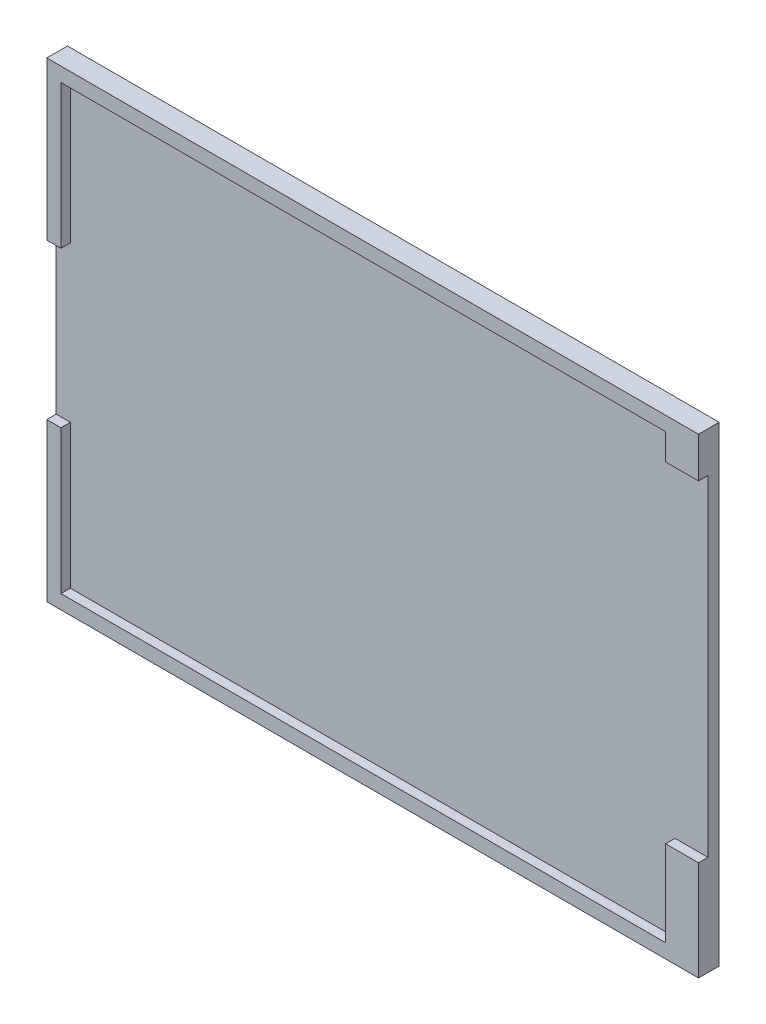
ISO-10303-21;
HEADER;
FILE_DESCRIPTION(('STEP AP214'),'2;1');
FILE_NAME('part.step','',(''),(''),'','','');
FILE_SCHEMA(('AUTOMOTIVE_DESIGN { 1 0 10303 214 1 1 1 1 }'));
ENDSEC;
DATA;
#1=APPLICATION_CONTEXT('core data for automotive mechanical design processes');
#2=APPLICATION_PROTOCOL_DEFINITION('international standard','automotive_design',2000,#1);
#3=PRODUCT_CONTEXT('',#1,'mechanical');
#4=PRODUCT('Part','Part','',(#3));
#5=PRODUCT_RELATED_PRODUCT_CATEGORY('part','',(#4));
#6=PRODUCT_DEFINITION_FORMATION('','',#4);
#7=PRODUCT_DEFINITION_CONTEXT('part definition',#1,'design');
#8=PRODUCT_DEFINITION('design','',#6,#7);
#9=PRODUCT_DEFINITION_SHAPE('','',#8);
#10=(LENGTH_UNIT() NAMED_UNIT(*) SI_UNIT(.MILLI.,.METRE.));
#11=(NAMED_UNIT(*) PLANE_ANGLE_UNIT() SI_UNIT($,.RADIAN.));
#12=(NAMED_UNIT(*) SI_UNIT($,.STERADIAN.) SOLID_ANGLE_UNIT());
#13=UNCERTAINTY_MEASURE_WITH_UNIT(LENGTH_MEASURE(1.E-05),#10,'distance_accuracy_value','');
#14=(GEOMETRIC_REPRESENTATION_CONTEXT(3) GLOBAL_UNCERTAINTY_ASSIGNED_CONTEXT((#13)) GLOBAL_UNIT_ASSIGNED_CONTEXT((#10,
#11,#12)) REPRESENTATION_CONTEXT('',''));
#15=CARTESIAN_POINT('',(0.,0.,0.));
#16=DIRECTION('',(0.,0.,1.));
#17=DIRECTION('',(1.,0.,0.));
#18=AXIS2_PLACEMENT_3D('',#15,#16,#17);
#19=CARTESIAN_POINT('',(0.,0.,2.2));
#20=DIRECTION('',(0.,0.,-1.));
#21=DIRECTION('',(-1.,0.,0.));
#22=AXIS2_PLACEMENT_3D('',#19,#20,#21);
#23=PLANE('',#22);
#24=DIRECTION('',(0.,-1.,0.));
#25=VECTOR('',#24,1.);
#26=CARTESIAN_POINT('',(-34.6,-25.,2.2));
#27=LINE('',#26,#25);
#28=CARTESIAN_POINT('',(-34.6,25.,2.2));
#29=VERTEX_POINT('',#28);
#30=CARTESIAN_POINT('',(-34.6,8.25,2.2));
#31=VERTEX_POINT('',#30);
#32=EDGE_CURVE('E190',#29,#31,#27,.T.);
#33=ORIENTED_EDGE('',*,*,#32,.T.);
#34=DIRECTION('',(-1.,0.,0.));
#35=VECTOR('',#34,1.);
#36=CARTESIAN_POINT('',(-34.5108366178629,8.25,2.2));
#37=LINE('',#36,#35);
#38=CARTESIAN_POINT('',(-33.0953892850898,8.24999999999999,2.2));
#39=VERTEX_POINT('',#38);
#40=EDGE_CURVE('E173',#39,#31,#37,.T.);
#41=ORIENTED_EDGE('',*,*,#40,.F.);
#42=DIRECTION('',(0.,-1.,0.));
#43=VECTOR('',#42,1.);
#44=CARTESIAN_POINT('',(-33.0953892850898,23.4955863264488,2.2));
#45=LINE('',#44,#43);
#46=CARTESIAN_POINT('',(-33.0953892850898,23.4955863264488,2.2));
#47=VERTEX_POINT('',#46);
#48=EDGE_CURVE('E311',#47,#39,#45,.T.);
#49=ORIENTED_EDGE('',*,*,#48,.F.);
#50=DIRECTION('',(-1.,0.,0.));
#51=VECTOR('',#50,1.);
#52=CARTESIAN_POINT('',(31.1043201226952,23.4955863264488,2.2));
#53=LINE('',#52,#51);
#54=CARTESIAN_POINT('',(31.1043201226952,23.4955863264488,2.2));
#55=VERTEX_POINT('',#54);
#56=EDGE_CURVE('E308',#55,#47,#53,.T.);
#57=ORIENTED_EDGE('',*,*,#56,.F.);
#58=DIRECTION('',(0.,1.,0.));
#59=VECTOR('',#58,1.);
#60=CARTESIAN_POINT('',(31.1043201226952,20.7043143379455,2.2));
#61=LINE('',#60,#59);
#62=CARTESIAN_POINT('',(31.1043201226952,20.7043143379455,2.2));
#63=VERTEX_POINT('',#62);
#64=EDGE_CURVE('E305',#63,#55,#61,.T.);
#65=ORIENTED_EDGE('',*,*,#64,.F.);
#66=DIRECTION('',(-1.,0.,0.));
#67=VECTOR('',#66,1.);
#68=CARTESIAN_POINT('',(34.6,20.7043143379455,2.2));
#69=LINE('',#68,#67);
#70=CARTESIAN_POINT('',(34.6,20.7043143379455,2.2));
#71=VERTEX_POINT('',#70);
#72=EDGE_CURVE('E302',#71,#63,#69,.T.);
#73=ORIENTED_EDGE('',*,*,#72,.F.);
#74=DIRECTION('',(0.,1.,0.));
#75=VECTOR('',#74,1.);
#76=CARTESIAN_POINT('',(34.6,-25.,2.2));
#77=LINE('',#76,#75);
#78=CARTESIAN_POINT('',(34.6,25.,2.2));
#79=VERTEX_POINT('',#78);
#80=EDGE_CURVE('E85',#71,#79,#77,.T.);
#81=ORIENTED_EDGE('',*,*,#80,.T.);
#82=DIRECTION('',(-1.,0.,0.));
#83=VECTOR('',#82,1.);
#84=CARTESIAN_POINT('',(-34.6,25.,2.2));
#85=LINE('',#84,#83);
#86=EDGE_CURVE('E188',#79,#29,#85,.T.);
#87=ORIENTED_EDGE('',*,*,#86,.T.);
#88=EDGE_LOOP('',(#33,#41,#49,#57,#65,#73,#81,#87));
#89=FACE_BOUND('',#88,.T.);
#90=ADVANCED_FACE('F32',(#89),#23,.F.);
#91=CARTESIAN_POINT('',(34.6,-25.,2.2));
#92=DIRECTION('',(-1.,0.,0.));
#93=DIRECTION('',(0.,0.,1.));
#94=AXIS2_PLACEMENT_3D('',#91,#92,#93);
#95=PLANE('',#94);
#96=ORIENTED_EDGE('',*,*,#80,.F.);
#97=DIRECTION('',(0.,0.,1.));
#98=VECTOR('',#97,1.);
#99=CARTESIAN_POINT('',(34.6,20.7043143379455,1.2));
#100=LINE('',#99,#98);
#101=CARTESIAN_POINT('',(34.6,20.7043143379455,1.2));
#102=VERTEX_POINT('',#101);
#103=EDGE_CURVE('E324',#102,#71,#100,.T.);
#104=ORIENTED_EDGE('',*,*,#103,.F.);
#105=DIRECTION('',(0.,1.,0.));
#106=VECTOR('',#105,1.);
#107=CARTESIAN_POINT('',(34.6,-14.4042589759396,1.2));
#108=LINE('',#107,#106);
#109=CARTESIAN_POINT('',(34.6,-14.4042589759396,1.2));
#110=VERTEX_POINT('',#109);
#111=EDGE_CURVE('E343',#110,#102,#108,.T.);
#112=ORIENTED_EDGE('',*,*,#111,.F.);
#113=DIRECTION('',(0.,0.,1.));
#114=VECTOR('',#113,1.);
#115=CARTESIAN_POINT('',(34.6,-14.4042589759396,1.2));
#116=LINE('',#115,#114);
#117=CARTESIAN_POINT('',(34.6,-14.4042589759396,2.2));
#118=VERTEX_POINT('',#117);
#119=EDGE_CURVE('E326',#110,#118,#116,.T.);
#120=ORIENTED_EDGE('',*,*,#119,.T.);
#121=CARTESIAN_POINT('',(34.6,-25.,2.2));
#122=VERTEX_POINT('',#121);
#123=EDGE_CURVE('E186',#122,#118,#77,.T.);
#124=ORIENTED_EDGE('',*,*,#123,.F.);
#125=DIRECTION('',(0.,0.,-1.));
#126=VECTOR('',#125,1.);
#127=CARTESIAN_POINT('',(34.6,-25.,2.2));
#128=LINE('',#127,#126);
#129=CARTESIAN_POINT('',(34.6,-25.,0.));
#130=VERTEX_POINT('',#129);
#131=EDGE_CURVE('E194',#122,#130,#128,.T.);
#132=ORIENTED_EDGE('',*,*,#131,.T.);
#133=DIRECTION('',(0.,1.,0.));
#134=VECTOR('',#133,1.);
#135=CARTESIAN_POINT('',(34.6,-25.,0.));
#136=LINE('',#135,#134);
#137=CARTESIAN_POINT('',(34.6,25.,0.));
#138=VERTEX_POINT('',#137);
#139=EDGE_CURVE('E195',#130,#138,#136,.T.);
#140=ORIENTED_EDGE('',*,*,#139,.T.);
#141=DIRECTION('',(0.,0.,-1.));
#142=VECTOR('',#141,1.);
#143=CARTESIAN_POINT('',(34.6,25.,2.2));
#144=LINE('',#143,#142);
#145=EDGE_CURVE('E11',#79,#138,#144,.T.);
#146=ORIENTED_EDGE('',*,*,#145,.F.);
#147=EDGE_LOOP('',(#96,#104,#112,#120,#124,#132,#140,#146));
#148=FACE_BOUND('',#147,.T.);
#149=ADVANCED_FACE('F34',(#148),#95,.F.);
#150=CARTESIAN_POINT('',(-34.6,25.,2.2));
#151=DIRECTION('',(0.,-1.,0.));
#152=DIRECTION('',(0.,0.,-1.));
#153=AXIS2_PLACEMENT_3D('',#150,#151,#152);
#154=PLANE('',#153);
#155=DIRECTION('',(-1.,0.,0.));
#156=VECTOR('',#155,1.);
#157=CARTESIAN_POINT('',(-34.6,25.,0.));
#158=LINE('',#157,#156);
#159=CARTESIAN_POINT('',(-34.6,25.,0.));
#160=VERTEX_POINT('',#159);
#161=EDGE_CURVE('E198',#138,#160,#158,.T.);
#162=ORIENTED_EDGE('',*,*,#161,.T.);
#163=DIRECTION('',(0.,0.,-1.));
#164=VECTOR('',#163,1.);
#165=CARTESIAN_POINT('',(-34.6,25.,2.2));
#166=LINE('',#165,#164);
#167=EDGE_CURVE('E40',#29,#160,#166,.T.);
#168=ORIENTED_EDGE('',*,*,#167,.F.);
#169=ORIENTED_EDGE('',*,*,#86,.F.);
#170=ORIENTED_EDGE('',*,*,#145,.T.);
#171=EDGE_LOOP('',(#162,#168,#169,#170));
#172=FACE_BOUND('',#171,.T.);
#173=ADVANCED_FACE('F229',(#172),#154,.F.);
#174=CARTESIAN_POINT('',(-34.6,-25.,2.2));
#175=DIRECTION('',(1.,0.,0.));
#176=DIRECTION('',(0.,0.,-1.));
#177=AXIS2_PLACEMENT_3D('',#174,#175,#176);
#178=PLANE('',#177);
#179=DIRECTION('',(0.,-1.,0.));
#180=VECTOR('',#179,1.);
#181=CARTESIAN_POINT('',(-34.6,8.25,1.2));
#182=LINE('',#181,#180);
#183=CARTESIAN_POINT('',(-34.6,8.25,1.2));
#184=VERTEX_POINT('',#183);
#185=CARTESIAN_POINT('',(-34.6,-8.25,1.2));
#186=VERTEX_POINT('',#185);
#187=EDGE_CURVE('E163',#184,#186,#182,.T.);
#188=ORIENTED_EDGE('',*,*,#187,.F.);
#189=DIRECTION('',(0.,0.,1.));
#190=VECTOR('',#189,1.);
#191=CARTESIAN_POINT('',(-34.6,8.25,1.2));
#192=LINE('',#191,#190);
#193=EDGE_CURVE('E199',#184,#31,#192,.T.);
#194=ORIENTED_EDGE('',*,*,#193,.T.);
#195=ORIENTED_EDGE('',*,*,#32,.F.);
#196=ORIENTED_EDGE('',*,*,#167,.T.);
#197=DIRECTION('',(0.,-1.,0.));
#198=VECTOR('',#197,1.);
#199=CARTESIAN_POINT('',(-34.6,-25.,0.));
#200=LINE('',#199,#198);
#201=CARTESIAN_POINT('',(-34.6,-25.,0.));
#202=VERTEX_POINT('',#201);
#203=EDGE_CURVE('E201',#160,#202,#200,.T.);
#204=ORIENTED_EDGE('',*,*,#203,.T.);
#205=DIRECTION('',(0.,0.,-1.));
#206=VECTOR('',#205,1.);
#207=CARTESIAN_POINT('',(-34.6,-25.,2.2));
#208=LINE('',#207,#206);
#209=CARTESIAN_POINT('',(-34.6,-25.,2.2));
#210=VERTEX_POINT('',#209);
#211=EDGE_CURVE('E205',#210,#202,#208,.T.);
#212=ORIENTED_EDGE('',*,*,#211,.F.);
#213=CARTESIAN_POINT('',(-34.6,-8.25,2.2));
#214=VERTEX_POINT('',#213);
#215=EDGE_CURVE('E178',#214,#210,#27,.T.);
#216=ORIENTED_EDGE('',*,*,#215,.F.);
#217=DIRECTION('',(0.,0.,1.));
#218=VECTOR('',#217,1.);
#219=CARTESIAN_POINT('',(-34.6,-8.25,1.2));
#220=LINE('',#219,#218);
#221=EDGE_CURVE('E47',#186,#214,#220,.T.);
#222=ORIENTED_EDGE('',*,*,#221,.F.);
#223=EDGE_LOOP('',(#188,#194,#195,#196,#204,#212,#216,#222));
#224=FACE_BOUND('',#223,.T.);
#225=ADVANCED_FACE('F176',(#224),#178,.F.);
#226=CARTESIAN_POINT('',(-34.6,-25.,2.2));
#227=DIRECTION('',(0.,1.,0.));
#228=DIRECTION('',(0.,0.,1.));
#229=AXIS2_PLACEMENT_3D('',#226,#227,#228);
#230=PLANE('',#229);
#231=DIRECTION('',(1.,0.,0.));
#232=VECTOR('',#231,1.);
#233=CARTESIAN_POINT('',(-34.6,-25.,0.));
#234=LINE('',#233,#232);
#235=EDGE_CURVE('E77',#202,#130,#234,.T.);
#236=ORIENTED_EDGE('',*,*,#235,.T.);
#237=ORIENTED_EDGE('',*,*,#131,.F.);
#238=DIRECTION('',(1.,0.,0.));
#239=VECTOR('',#238,1.);
#240=CARTESIAN_POINT('',(-34.6,-25.,2.2));
#241=LINE('',#240,#239);
#242=EDGE_CURVE('E56',#210,#122,#241,.T.);
#243=ORIENTED_EDGE('',*,*,#242,.F.);
#244=ORIENTED_EDGE('',*,*,#211,.T.);
#245=EDGE_LOOP('',(#236,#237,#243,#244));
#246=FACE_BOUND('',#245,.T.);
#247=ADVANCED_FACE('F218',(#246),#230,.F.);
#248=ORIENTED_EDGE('',*,*,#123,.T.);
#249=DIRECTION('',(1.,0.,0.));
#250=VECTOR('',#249,1.);
#251=CARTESIAN_POINT('',(31.1043201226953,-14.4042589759396,2.2));
#252=LINE('',#251,#250);
#253=CARTESIAN_POINT('',(31.1043201226953,-14.4042589759396,2.2));
#254=VERTEX_POINT('',#253);
#255=EDGE_CURVE('E297',#254,#118,#252,.T.);
#256=ORIENTED_EDGE('',*,*,#255,.F.);
#257=DIRECTION('',(0.,1.,0.));
#258=VECTOR('',#257,1.);
#259=CARTESIAN_POINT('',(31.1043201226953,-23.5,2.2));
#260=LINE('',#259,#258);
#261=CARTESIAN_POINT('',(31.1043201226953,-23.5,2.2));
#262=VERTEX_POINT('',#261);
#263=EDGE_CURVE('E295',#262,#254,#260,.T.);
#264=ORIENTED_EDGE('',*,*,#263,.F.);
#265=DIRECTION('',(1.,0.,0.));
#266=VECTOR('',#265,1.);
#267=CARTESIAN_POINT('',(-33.0953892850898,-23.5,2.2));
#268=LINE('',#267,#266);
#269=CARTESIAN_POINT('',(-33.0953892850898,-23.5,2.2));
#270=VERTEX_POINT('',#269);
#271=EDGE_CURVE('E288',#270,#262,#268,.T.);
#272=ORIENTED_EDGE('',*,*,#271,.F.);
#273=DIRECTION('',(0.,-1.,0.));
#274=VECTOR('',#273,1.);
#275=CARTESIAN_POINT('',(-33.0953892850898,-8.25,2.2));
#276=LINE('',#275,#274);
#277=CARTESIAN_POINT('',(-33.0953892850898,-8.25,2.2));
#278=VERTEX_POINT('',#277);
#279=EDGE_CURVE('E285',#278,#270,#276,.T.);
#280=ORIENTED_EDGE('',*,*,#279,.F.);
#281=DIRECTION('',(1.,0.,0.));
#282=VECTOR('',#281,1.);
#283=CARTESIAN_POINT('',(-34.6,-8.25,2.2));
#284=LINE('',#283,#282);
#285=EDGE_CURVE('E289',#214,#278,#284,.T.);
#286=ORIENTED_EDGE('',*,*,#285,.F.);
#287=ORIENTED_EDGE('',*,*,#215,.T.);
#288=ORIENTED_EDGE('',*,*,#242,.T.);
#289=EDGE_LOOP('',(#248,#256,#264,#272,#280,#286,#287,#288));
#290=FACE_BOUND('',#289,.T.);
#291=ADVANCED_FACE('F220',(#290),#23,.F.);
#292=CARTESIAN_POINT('',(0.,0.,0.));
#293=DIRECTION('',(0.,0.,-1.));
#294=DIRECTION('',(-1.,0.,0.));
#295=AXIS2_PLACEMENT_3D('',#292,#293,#294);
#296=PLANE('',#295);
#297=ORIENTED_EDGE('',*,*,#139,.F.);
#298=ORIENTED_EDGE('',*,*,#235,.F.);
#299=ORIENTED_EDGE('',*,*,#203,.F.);
#300=ORIENTED_EDGE('',*,*,#161,.F.);
#301=EDGE_LOOP('',(#297,#298,#299,#300));
#302=FACE_BOUND('',#301,.T.);
#303=ADVANCED_FACE('F213',(#302),#296,.T.);
#304=CARTESIAN_POINT('',(-34.5108366178629,8.25,1.2));
#305=DIRECTION('',(0.,1.,0.));
#306=DIRECTION('',(0.,0.,1.));
#307=AXIS2_PLACEMENT_3D('',#304,#305,#306);
#308=PLANE('',#307);
#309=ORIENTED_EDGE('',*,*,#40,.T.);
#310=ORIENTED_EDGE('',*,*,#193,.F.);
#311=DIRECTION('',(-1.,0.,0.));
#312=VECTOR('',#311,1.);
#313=CARTESIAN_POINT('',(-33.0953892850898,8.24999999999999,1.2));
#314=LINE('',#313,#312);
#315=CARTESIAN_POINT('',(-33.0953892850898,8.24999999999999,1.2));
#316=VERTEX_POINT('',#315);
#317=EDGE_CURVE('E169',#316,#184,#314,.T.);
#318=ORIENTED_EDGE('',*,*,#317,.F.);
#319=DIRECTION('',(0.,0.,1.));
#320=VECTOR('',#319,1.);
#321=CARTESIAN_POINT('',(-33.0953892850898,8.24999999999999,1.2));
#322=LINE('',#321,#320);
#323=EDGE_CURVE('E316',#316,#39,#322,.T.);
#324=ORIENTED_EDGE('',*,*,#323,.T.);
#325=EDGE_LOOP('',(#309,#310,#318,#324));
#326=FACE_BOUND('',#325,.T.);
#327=ADVANCED_FACE('F240',(#326),#308,.F.);
#328=CARTESIAN_POINT('',(-33.0953892850898,23.4955863264488,1.2));
#329=DIRECTION('',(-1.,0.,0.));
#330=DIRECTION('',(0.,0.,1.));
#331=AXIS2_PLACEMENT_3D('',#328,#329,#330);
#332=PLANE('',#331);
#333=ORIENTED_EDGE('',*,*,#48,.T.);
#334=ORIENTED_EDGE('',*,*,#323,.F.);
#335=DIRECTION('',(0.,-1.,0.));
#336=VECTOR('',#335,1.);
#337=CARTESIAN_POINT('',(-33.0953892850898,23.4955863264488,1.2));
#338=LINE('',#337,#336);
#339=CARTESIAN_POINT('',(-33.0953892850898,23.4955863264488,1.2));
#340=VERTEX_POINT('',#339);
#341=EDGE_CURVE('E182',#340,#316,#338,.T.);
#342=ORIENTED_EDGE('',*,*,#341,.F.);
#343=DIRECTION('',(0.,0.,1.));
#344=VECTOR('',#343,1.);
#345=CARTESIAN_POINT('',(-33.0953892850898,23.4955863264488,1.2));
#346=LINE('',#345,#344);
#347=EDGE_CURVE('E318',#340,#47,#346,.T.);
#348=ORIENTED_EDGE('',*,*,#347,.T.);
#349=EDGE_LOOP('',(#333,#334,#342,#348));
#350=FACE_BOUND('',#349,.T.);
#351=ADVANCED_FACE('F244',(#350),#332,.F.);
#352=CARTESIAN_POINT('',(31.1043201226952,23.4955863264488,1.2));
#353=DIRECTION('',(0.,1.,0.));
#354=DIRECTION('',(0.,0.,1.));
#355=AXIS2_PLACEMENT_3D('',#352,#353,#354);
#356=PLANE('',#355);
#357=ORIENTED_EDGE('',*,*,#56,.T.);
#358=ORIENTED_EDGE('',*,*,#347,.F.);
#359=DIRECTION('',(-1.,0.,0.));
#360=VECTOR('',#359,1.);
#361=CARTESIAN_POINT('',(31.1043201226952,23.4955863264488,1.2));
#362=LINE('',#361,#360);
#363=CARTESIAN_POINT('',(31.1043201226952,23.4955863264488,1.2));
#364=VERTEX_POINT('',#363);
#365=EDGE_CURVE('E352',#364,#340,#362,.T.);
#366=ORIENTED_EDGE('',*,*,#365,.F.);
#367=DIRECTION('',(0.,0.,1.));
#368=VECTOR('',#367,1.);
#369=CARTESIAN_POINT('',(31.1043201226952,23.4955863264488,1.2));
#370=LINE('',#369,#368);
#371=EDGE_CURVE('E320',#364,#55,#370,.T.);
#372=ORIENTED_EDGE('',*,*,#371,.T.);
#373=EDGE_LOOP('',(#357,#358,#366,#372));
#374=FACE_BOUND('',#373,.T.);
#375=ADVANCED_FACE('F250',(#374),#356,.F.);
#376=CARTESIAN_POINT('',(31.1043201226952,20.7043143379455,1.2));
#377=DIRECTION('',(1.,0.,0.));
#378=DIRECTION('',(0.,0.,-1.));
#379=AXIS2_PLACEMENT_3D('',#376,#377,#378);
#380=PLANE('',#379);
#381=ORIENTED_EDGE('',*,*,#64,.T.);
#382=ORIENTED_EDGE('',*,*,#371,.F.);
#383=DIRECTION('',(0.,1.,0.));
#384=VECTOR('',#383,1.);
#385=CARTESIAN_POINT('',(31.1043201226952,20.7043143379455,1.2));
#386=LINE('',#385,#384);
#387=CARTESIAN_POINT('',(31.1043201226952,20.7043143379455,1.2));
#388=VERTEX_POINT('',#387);
#389=EDGE_CURVE('E349',#388,#364,#386,.T.);
#390=ORIENTED_EDGE('',*,*,#389,.F.);
#391=DIRECTION('',(0.,0.,1.));
#392=VECTOR('',#391,1.);
#393=CARTESIAN_POINT('',(31.1043201226952,20.7043143379455,1.2));
#394=LINE('',#393,#392);
#395=EDGE_CURVE('E322',#388,#63,#394,.T.);
#396=ORIENTED_EDGE('',*,*,#395,.T.);
#397=EDGE_LOOP('',(#381,#382,#390,#396));
#398=FACE_BOUND('',#397,.T.);
#399=ADVANCED_FACE('F257',(#398),#380,.F.);
#400=CARTESIAN_POINT('',(34.6,20.7043143379455,1.2));
#401=DIRECTION('',(0.,1.,0.));
#402=DIRECTION('',(0.,0.,1.));
#403=AXIS2_PLACEMENT_3D('',#400,#401,#402);
#404=PLANE('',#403);
#405=ORIENTED_EDGE('',*,*,#72,.T.);
#406=ORIENTED_EDGE('',*,*,#395,.F.);
#407=DIRECTION('',(-1.,0.,0.));
#408=VECTOR('',#407,1.);
#409=CARTESIAN_POINT('',(34.6,20.7043143379455,1.2));
#410=LINE('',#409,#408);
#411=EDGE_CURVE('E346',#102,#388,#410,.T.);
#412=ORIENTED_EDGE('',*,*,#411,.F.);
#413=ORIENTED_EDGE('',*,*,#103,.T.);
#414=EDGE_LOOP('',(#405,#406,#412,#413));
#415=FACE_BOUND('',#414,.T.);
#416=ADVANCED_FACE('F261',(#415),#404,.F.);
#417=CARTESIAN_POINT('',(31.1043201226953,-14.4042589759396,1.2));
#418=DIRECTION('',(0.,-1.,0.));
#419=DIRECTION('',(1.,0.,0.));
#420=AXIS2_PLACEMENT_3D('',#417,#418,#419);
#421=PLANE('',#420);
#422=ORIENTED_EDGE('',*,*,#255,.T.);
#423=ORIENTED_EDGE('',*,*,#119,.F.);
#424=DIRECTION('',(1.,0.,0.));
#425=VECTOR('',#424,1.);
#426=CARTESIAN_POINT('',(31.1043201226953,-14.4042589759396,1.2));
#427=LINE('',#426,#425);
#428=CARTESIAN_POINT('',(31.1043201226953,-14.4042589759396,1.2));
#429=VERTEX_POINT('',#428);
#430=EDGE_CURVE('E340',#429,#110,#427,.T.);
#431=ORIENTED_EDGE('',*,*,#430,.F.);
#432=DIRECTION('',(0.,0.,1.));
#433=VECTOR('',#432,1.);
#434=CARTESIAN_POINT('',(31.1043201226953,-14.4042589759396,1.2));
#435=LINE('',#434,#433);
#436=EDGE_CURVE('E328',#429,#254,#435,.T.);
#437=ORIENTED_EDGE('',*,*,#436,.T.);
#438=EDGE_LOOP('',(#422,#423,#431,#437));
#439=FACE_BOUND('',#438,.T.);
#440=ADVANCED_FACE('F265',(#439),#421,.F.);
#441=CARTESIAN_POINT('',(31.1043201226953,-23.5,1.2));
#442=DIRECTION('',(1.,0.,0.));
#443=DIRECTION('',(0.,0.,-1.));
#444=AXIS2_PLACEMENT_3D('',#441,#442,#443);
#445=PLANE('',#444);
#446=ORIENTED_EDGE('',*,*,#263,.T.);
#447=ORIENTED_EDGE('',*,*,#436,.F.);
#448=DIRECTION('',(0.,1.,0.));
#449=VECTOR('',#448,1.);
#450=CARTESIAN_POINT('',(31.1043201226953,-23.5,1.2));
#451=LINE('',#450,#449);
#452=CARTESIAN_POINT('',(31.1043201226953,-23.5,1.2));
#453=VERTEX_POINT('',#452);
#454=EDGE_CURVE('E335',#453,#429,#451,.T.);
#455=ORIENTED_EDGE('',*,*,#454,.F.);
#456=DIRECTION('',(0.,0.,1.));
#457=VECTOR('',#456,1.);
#458=CARTESIAN_POINT('',(31.1043201226953,-23.5,1.2));
#459=LINE('',#458,#457);
#460=EDGE_CURVE('E330',#453,#262,#459,.T.);
#461=ORIENTED_EDGE('',*,*,#460,.T.);
#462=EDGE_LOOP('',(#446,#447,#455,#461));
#463=FACE_BOUND('',#462,.T.);
#464=ADVANCED_FACE('F269',(#463),#445,.F.);
#465=CARTESIAN_POINT('',(-33.0953892850898,-23.5,1.2));
#466=DIRECTION('',(0.,-1.,0.));
#467=DIRECTION('',(0.,0.,-1.));
#468=AXIS2_PLACEMENT_3D('',#465,#466,#467);
#469=PLANE('',#468);
#470=ORIENTED_EDGE('',*,*,#271,.T.);
#471=ORIENTED_EDGE('',*,*,#460,.F.);
#472=DIRECTION('',(1.,0.,0.));
#473=VECTOR('',#472,1.);
#474=CARTESIAN_POINT('',(-33.0953892850898,-23.5,1.2));
#475=LINE('',#474,#473);
#476=CARTESIAN_POINT('',(-33.0953892850898,-23.5,1.2));
#477=VERTEX_POINT('',#476);
#478=EDGE_CURVE('E332',#477,#453,#475,.T.);
#479=ORIENTED_EDGE('',*,*,#478,.F.);
#480=DIRECTION('',(0.,0.,1.));
#481=VECTOR('',#480,1.);
#482=CARTESIAN_POINT('',(-33.0953892850898,-23.5,1.2));
#483=LINE('',#482,#481);
#484=EDGE_CURVE('E180',#477,#270,#483,.T.);
#485=ORIENTED_EDGE('',*,*,#484,.T.);
#486=EDGE_LOOP('',(#470,#471,#479,#485));
#487=FACE_BOUND('',#486,.T.);
#488=ADVANCED_FACE('F273',(#487),#469,.F.);
#489=CARTESIAN_POINT('',(-33.0953892850898,-8.25,1.2));
#490=DIRECTION('',(-1.,0.,0.));
#491=DIRECTION('',(0.,0.,1.));
#492=AXIS2_PLACEMENT_3D('',#489,#490,#491);
#493=PLANE('',#492);
#494=ORIENTED_EDGE('',*,*,#279,.T.);
#495=ORIENTED_EDGE('',*,*,#484,.F.);
#496=DIRECTION('',(0.,-1.,0.));
#497=VECTOR('',#496,1.);
#498=CARTESIAN_POINT('',(-33.0953892850898,-8.25,1.2));
#499=LINE('',#498,#497);
#500=CARTESIAN_POINT('',(-33.0953892850898,-8.25,1.2));
#501=VERTEX_POINT('',#500);
#502=EDGE_CURVE('E162',#501,#477,#499,.T.);
#503=ORIENTED_EDGE('',*,*,#502,.F.);
#504=DIRECTION('',(0.,0.,1.));
#505=VECTOR('',#504,1.);
#506=CARTESIAN_POINT('',(-33.0953892850898,-8.25,1.2));
#507=LINE('',#506,#505);
#508=EDGE_CURVE('E158',#501,#278,#507,.T.);
#509=ORIENTED_EDGE('',*,*,#508,.T.);
#510=EDGE_LOOP('',(#494,#495,#503,#509));
#511=FACE_BOUND('',#510,.T.);
#512=ADVANCED_FACE('F276',(#511),#493,.F.);
#513=CARTESIAN_POINT('',(-34.6,-8.25,1.2));
#514=DIRECTION('',(0.,-1.,0.));
#515=DIRECTION('',(1.,0.,0.));
#516=AXIS2_PLACEMENT_3D('',#513,#514,#515);
#517=PLANE('',#516);
#518=ORIENTED_EDGE('',*,*,#285,.T.);
#519=ORIENTED_EDGE('',*,*,#508,.F.);
#520=DIRECTION('',(1.,0.,0.));
#521=VECTOR('',#520,1.);
#522=CARTESIAN_POINT('',(-34.6,-8.25,1.2));
#523=LINE('',#522,#521);
#524=EDGE_CURVE('E155',#186,#501,#523,.T.);
#525=ORIENTED_EDGE('',*,*,#524,.F.);
#526=ORIENTED_EDGE('',*,*,#221,.T.);
#527=EDGE_LOOP('',(#518,#519,#525,#526));
#528=FACE_BOUND('',#527,.T.);
#529=ADVANCED_FACE('F157',(#528),#517,.F.);
#530=CARTESIAN_POINT('',(0.,0.,1.2));
#531=DIRECTION('',(0.,0.,1.));
#532=DIRECTION('',(1.,0.,0.));
#533=AXIS2_PLACEMENT_3D('',#530,#531,#532);
#534=PLANE('',#533);
#535=ORIENTED_EDGE('',*,*,#187,.T.);
#536=ORIENTED_EDGE('',*,*,#524,.T.);
#537=ORIENTED_EDGE('',*,*,#502,.T.);
#538=ORIENTED_EDGE('',*,*,#478,.T.);
#539=ORIENTED_EDGE('',*,*,#454,.T.);
#540=ORIENTED_EDGE('',*,*,#430,.T.);
#541=ORIENTED_EDGE('',*,*,#111,.T.);
#542=ORIENTED_EDGE('',*,*,#411,.T.);
#543=ORIENTED_EDGE('',*,*,#389,.T.);
#544=ORIENTED_EDGE('',*,*,#365,.T.);
#545=ORIENTED_EDGE('',*,*,#341,.T.);
#546=ORIENTED_EDGE('',*,*,#317,.T.);
#547=EDGE_LOOP('',(#535,#536,#537,#538,#539,#540,#541,#542,#543,#544,#545,#546));
#548=FACE_BOUND('',#547,.T.);
#549=ADVANCED_FACE('F166',(#548),#534,.T.);
#550=CLOSED_SHELL('',(#90,#149,#173,#225,#247,#291,#303,#327,#351,#375,#399,#416,#440,#464,#488,
#512,#529,#549));
#551=MANIFOLD_SOLID_BREP('B2',#550);
#552=ADVANCED_BREP_SHAPE_REPRESENTATION('',(#18,#551),#14);
#553=SHAPE_DEFINITION_REPRESENTATION(#9,#552);
ENDSEC;
END-ISO-10303-21;
